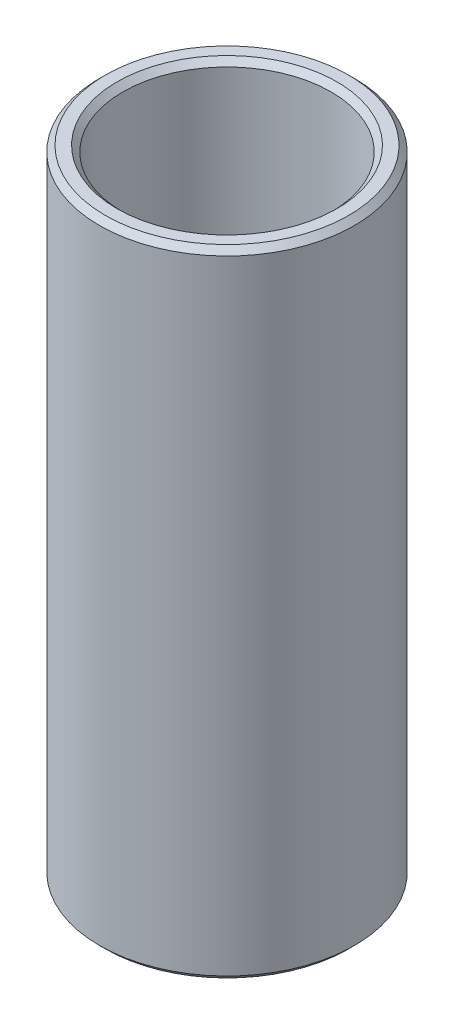
ISO-10303-21;
HEADER;
FILE_DESCRIPTION(('STEP AP214'),'2;1');
FILE_NAME('part.step','',(''),(''),'','','');
FILE_SCHEMA(('AUTOMOTIVE_DESIGN { 1 0 10303 214 1 1 1 1 }'));
ENDSEC;
DATA;
#1=APPLICATION_CONTEXT('core data for automotive mechanical design processes');
#2=APPLICATION_PROTOCOL_DEFINITION('international standard','automotive_design',2000,#1);
#3=PRODUCT_CONTEXT('',#1,'mechanical');
#4=PRODUCT('Part','Part','',(#3));
#5=PRODUCT_RELATED_PRODUCT_CATEGORY('part','',(#4));
#6=PRODUCT_DEFINITION_FORMATION('','',#4);
#7=PRODUCT_DEFINITION_CONTEXT('part definition',#1,'design');
#8=PRODUCT_DEFINITION('design','',#6,#7);
#9=PRODUCT_DEFINITION_SHAPE('','',#8);
#10=(LENGTH_UNIT() NAMED_UNIT(*) SI_UNIT(.MILLI.,.METRE.));
#11=(NAMED_UNIT(*) PLANE_ANGLE_UNIT() SI_UNIT($,.RADIAN.));
#12=(NAMED_UNIT(*) SI_UNIT($,.STERADIAN.) SOLID_ANGLE_UNIT());
#13=UNCERTAINTY_MEASURE_WITH_UNIT(LENGTH_MEASURE(1.E-05),#10,'distance_accuracy_value','');
#14=(GEOMETRIC_REPRESENTATION_CONTEXT(3) GLOBAL_UNCERTAINTY_ASSIGNED_CONTEXT((#13)) GLOBAL_UNIT_ASSIGNED_CONTEXT((#10,
#11,#12)) REPRESENTATION_CONTEXT('',''));
#15=CARTESIAN_POINT('',(0.,0.,0.));
#16=DIRECTION('',(0.,0.,1.));
#17=DIRECTION('',(1.,0.,0.));
#18=AXIS2_PLACEMENT_3D('',#15,#16,#17);
#19=CARTESIAN_POINT('',(0.,149.494594200961,0.));
#20=DIRECTION('',(0.,-1.,0.));
#21=DIRECTION('',(0.,0.,-1.));
#22=AXIS2_PLACEMENT_3D('',#19,#20,#21);
#23=CYLINDRICAL_SURFACE('',#22,30.);
#24=CARTESIAN_POINT('',(0.,1.36887821409001,0.));
#25=DIRECTION('',(0.,1.,0.));
#26=DIRECTION('',(0.,0.,1.));
#27=AXIS2_PLACEMENT_3D('',#24,#25,#26);
#28=CIRCLE('',#27,30.);
#29=CARTESIAN_POINT('',(0.,1.36887821409001,30.));
#30=VERTEX_POINT('',#29);
#31=EDGE_CURVE('E10',#30,#30,#28,.T.);
#32=ORIENTED_EDGE('',*,*,#31,.T.);
#33=EDGE_LOOP('',(#32));
#34=FACE_BOUND('',#33,.T.);
#35=CARTESIAN_POINT('',(0.,148.125715986871,0.));
#36=DIRECTION('',(0.,1.,0.));
#37=DIRECTION('',(0.,0.,1.));
#38=AXIS2_PLACEMENT_3D('',#35,#36,#37);
#39=CIRCLE('',#38,30.);
#40=CARTESIAN_POINT('',(0.,148.125715986871,30.));
#41=VERTEX_POINT('',#40);
#42=EDGE_CURVE('E50',#41,#41,#39,.F.);
#43=ORIENTED_EDGE('',*,*,#42,.T.);
#44=EDGE_LOOP('',(#43));
#45=FACE_BOUND('',#44,.T.);
#46=ADVANCED_FACE('F39',(#34,#45),#23,.T.);
#47=CARTESIAN_POINT('',(0.,149.494594200961,0.));
#48=DIRECTION('',(0.,1.,0.));
#49=DIRECTION('',(0.,0.,1.));
#50=AXIS2_PLACEMENT_3D('',#47,#48,#49);
#51=PLANE('',#50);
#52=CARTESIAN_POINT('',(0.,149.494594200961,0.));
#53=DIRECTION('',(0.,1.,0.));
#54=DIRECTION('',(0.,0.,1.));
#55=AXIS2_PLACEMENT_3D('',#52,#53,#54);
#56=CIRCLE('',#55,25.8759322180654);
#57=CARTESIAN_POINT('',(0.,149.494594200961,25.8759322180654));
#58=VERTEX_POINT('',#57);
#59=EDGE_CURVE('E58',#58,#58,#56,.F.);
#60=ORIENTED_EDGE('',*,*,#59,.T.);
#61=EDGE_LOOP('',(#60));
#62=FACE_BOUND('',#61,.T.);
#63=CARTESIAN_POINT('',(0.,149.494594200961,0.));
#64=DIRECTION('',(0.,1.,0.));
#65=DIRECTION('',(0.,0.,1.));
#66=AXIS2_PLACEMENT_3D('',#63,#64,#65);
#67=CIRCLE('',#66,28.63112178591);
#68=CARTESIAN_POINT('',(0.,149.494594200961,28.63112178591));
#69=VERTEX_POINT('',#68);
#70=EDGE_CURVE('E61',#69,#69,#67,.T.);
#71=ORIENTED_EDGE('',*,*,#70,.T.);
#72=EDGE_LOOP('',(#71));
#73=FACE_BOUND('',#72,.T.);
#74=ADVANCED_FACE('F88',(#62,#73),#51,.T.);
#75=CARTESIAN_POINT('',(0.,0.,0.));
#76=DIRECTION('',(0.,1.,0.));
#77=DIRECTION('',(0.,0.,1.));
#78=AXIS2_PLACEMENT_3D('',#75,#76,#77);
#79=PLANE('',#78);
#80=CARTESIAN_POINT('',(0.,0.,0.));
#81=DIRECTION('',(0.,1.,0.));
#82=DIRECTION('',(0.,0.,1.));
#83=AXIS2_PLACEMENT_3D('',#80,#81,#82);
#84=CIRCLE('',#83,25.8759322180654);
#85=CARTESIAN_POINT('',(0.,0.,25.8759322180654));
#86=VERTEX_POINT('',#85);
#87=EDGE_CURVE('E51',#86,#86,#84,.T.);
#88=ORIENTED_EDGE('',*,*,#87,.T.);
#89=EDGE_LOOP('',(#88));
#90=FACE_BOUND('',#89,.T.);
#91=CARTESIAN_POINT('',(0.,0.,0.));
#92=DIRECTION('',(0.,1.,0.));
#93=DIRECTION('',(0.,0.,1.));
#94=AXIS2_PLACEMENT_3D('',#91,#92,#93);
#95=CIRCLE('',#94,28.63112178591);
#96=CARTESIAN_POINT('',(0.,0.,28.63112178591));
#97=VERTEX_POINT('',#96);
#98=EDGE_CURVE('E54',#97,#97,#95,.F.);
#99=ORIENTED_EDGE('',*,*,#98,.T.);
#100=EDGE_LOOP('',(#99));
#101=FACE_BOUND('',#100,.T.);
#102=ADVANCED_FACE('F83',(#90,#101),#79,.F.);
#103=CARTESIAN_POINT('',(0.,149.494594200961,0.));
#104=DIRECTION('',(0.,-1.,0.));
#105=DIRECTION('',(0.,0.,-1.));
#106=AXIS2_PLACEMENT_3D('',#103,#104,#105);
#107=CYLINDRICAL_SURFACE('',#106,24.5070540039754);
#108=CARTESIAN_POINT('',(0.,148.125715986871,0.));
#109=DIRECTION('',(0.,1.,0.));
#110=DIRECTION('',(0.,0.,1.));
#111=AXIS2_PLACEMENT_3D('',#108,#109,#110);
#112=CIRCLE('',#111,24.5070540039754);
#113=CARTESIAN_POINT('',(0.,148.125715986871,24.5070540039754));
#114=VERTEX_POINT('',#113);
#115=EDGE_CURVE('E67',#114,#114,#112,.T.);
#116=ORIENTED_EDGE('',*,*,#115,.T.);
#117=EDGE_LOOP('',(#116));
#118=FACE_BOUND('',#117,.T.);
#119=CARTESIAN_POINT('',(0.,1.36887821409004,0.));
#120=DIRECTION('',(0.,1.,0.));
#121=DIRECTION('',(0.,0.,1.));
#122=AXIS2_PLACEMENT_3D('',#119,#120,#121);
#123=CIRCLE('',#122,24.5070540039754);
#124=CARTESIAN_POINT('',(0.,1.36887821409004,24.5070540039754));
#125=VERTEX_POINT('',#124);
#126=EDGE_CURVE('E69',#125,#125,#123,.F.);
#127=ORIENTED_EDGE('',*,*,#126,.T.);
#128=EDGE_LOOP('',(#127));
#129=FACE_BOUND('',#128,.T.);
#130=ADVANCED_FACE('F71',(#118,#129),#107,.F.);
#131=CARTESIAN_POINT('',(0.,148.125715986871,0.));
#132=DIRECTION('',(0.,1.,0.));
#133=DIRECTION('',(0.,0.,1.));
#134=AXIS2_PLACEMENT_3D('',#131,#132,#133);
#135=CONICAL_SURFACE('',#134,24.5070540039754,0.785398163397448);
#136=CARTESIAN_POINT('',(0.,149.494594200961,25.8759322180654));
#137=CARTESIAN_POINT('',(0.,149.480335052897,25.8616730700019));
#138=CARTESIAN_POINT('',(0.,149.466075904834,25.8474139219385));
#139=CARTESIAN_POINT('',(0.,149.437557608707,25.8188956258116));
#140=CARTESIAN_POINT('',(0.,149.423298460644,25.8046364777482));
#141=CARTESIAN_POINT('',(0.,149.394780164517,25.7761181816213));
#142=CARTESIAN_POINT('',(0.,149.380521016453,25.7618590335579));
#143=CARTESIAN_POINT('',(0.,149.352002720326,25.733340737431));
#144=CARTESIAN_POINT('',(0.,149.337743572263,25.7190815893676));
#145=CARTESIAN_POINT('',(0.,149.309225276136,25.6905632932407));
#146=CARTESIAN_POINT('',(0.,149.294966128073,25.6763041451772));
#147=CARTESIAN_POINT('',(0.,149.266447831946,25.6477858490504));
#148=CARTESIAN_POINT('',(0.,149.252188683882,25.6335267009869));
#149=CARTESIAN_POINT('',(0.,149.223670387755,25.6050084048601));
#150=CARTESIAN_POINT('',(0.,149.209411239692,25.5907492567966));
#151=CARTESIAN_POINT('',(0.,149.180892943565,25.5622309606697));
#152=CARTESIAN_POINT('',(0.,149.166633795502,25.5479718126063));
#153=CARTESIAN_POINT('',(0.,149.138115499375,25.5194535164794));
#154=CARTESIAN_POINT('',(0.,149.123856351311,25.505194368416));
#155=CARTESIAN_POINT('',(0.,149.095338055185,25.4766760722891));
#156=CARTESIAN_POINT('',(0.,149.081078907121,25.4624169242257));
#157=CARTESIAN_POINT('',(0.,149.052560610994,25.4338986280988));
#158=CARTESIAN_POINT('',(0.,149.038301462931,25.4196394800354));
#159=CARTESIAN_POINT('',(0.,149.009783166804,25.3911211839085));
#160=CARTESIAN_POINT('',(0.,148.99552401874,25.3768620358451));
#161=CARTESIAN_POINT('',(0.,148.967005722614,25.3483437397182));
#162=CARTESIAN_POINT('',(0.,148.95274657455,25.3340845916547));
#163=CARTESIAN_POINT('',(0.,148.924228278423,25.3055662955279));
#164=CARTESIAN_POINT('',(0.,148.90996913036,25.2913071474644));
#165=CARTESIAN_POINT('',(0.,148.881450834233,25.2627888513376));
#166=CARTESIAN_POINT('',(0.,148.86719168617,25.2485297032741));
#167=CARTESIAN_POINT('',(0.,148.838673390043,25.2200114071472));
#168=CARTESIAN_POINT('',(0.,148.824414241979,25.2057522590838));
#169=CARTESIAN_POINT('',(0.,148.795895945852,25.1772339629569));
#170=CARTESIAN_POINT('',(0.,148.781636797789,25.1629748148935));
#171=CARTESIAN_POINT('',(0.,148.753118501662,25.1344565187666));
#172=CARTESIAN_POINT('',(0.,148.738859353599,25.1201973707032));
#173=CARTESIAN_POINT('',(0.,148.710341057472,25.0916790745763));
#174=CARTESIAN_POINT('',(0.,148.696081909408,25.0774199265129));
#175=CARTESIAN_POINT('',(0.,148.667563613281,25.048901630386));
#176=CARTESIAN_POINT('',(0.,148.653304465218,25.0346424823226));
#177=CARTESIAN_POINT('',(0.,148.624786169091,25.0061241861957));
#178=CARTESIAN_POINT('',(0.,148.610527021028,24.9918650381322));
#179=CARTESIAN_POINT('',(0.,148.582008724901,24.9633467420054));
#180=CARTESIAN_POINT('',(0.,148.567749576837,24.9490875939419));
#181=CARTESIAN_POINT('',(0.,148.53923128071,24.9205692978151));
#182=CARTESIAN_POINT('',(0.,148.524972132647,24.9063101497516));
#183=CARTESIAN_POINT('',(0.,148.49645383652,24.8777918536247));
#184=CARTESIAN_POINT('',(0.,148.482194688457,24.8635327055613));
#185=CARTESIAN_POINT('',(0.,148.45367639233,24.8350144094344));
#186=CARTESIAN_POINT('',(0.,148.439417244266,24.820755261371));
#187=CARTESIAN_POINT('',(0.,148.41089894814,24.7922369652441));
#188=CARTESIAN_POINT('',(0.,148.396639800076,24.7779778171807));
#189=CARTESIAN_POINT('',(0.,148.368121503949,24.7494595210538));
#190=CARTESIAN_POINT('',(0.,148.353862355886,24.7352003729904));
#191=CARTESIAN_POINT('',(0.,148.325344059759,24.7066820768635));
#192=CARTESIAN_POINT('',(0.,148.311084911695,24.6924229288001));
#193=CARTESIAN_POINT('',(0.,148.282566615569,24.6639046326732));
#194=CARTESIAN_POINT('',(0.,148.268307467505,24.6496454846097));
#195=CARTESIAN_POINT('',(0.,148.239789171378,24.6211271884829));
#196=CARTESIAN_POINT('',(0.,148.225530023315,24.6068680404194));
#197=CARTESIAN_POINT('',(0.,148.197011727188,24.5783497442926));
#198=CARTESIAN_POINT('',(0.,148.182752579124,24.5640905962291));
#199=CARTESIAN_POINT('',(0.,148.154234282998,24.5355723001022));
#200=CARTESIAN_POINT('',(0.,148.139975134934,24.5213131520388));
#201=CARTESIAN_POINT('',(0.,148.125715986871,24.5070540039754));
#202=B_SPLINE_CURVE_WITH_KNOTS('',3,(#136,#137,#138,#139,#140,#141,#142,#143,#144,#145,#146,
#147,#148,#149,#150,#151,#152,#153,#154,#155,#156,#157,#158,#159,#160,#161,#162,#163,#164,#165,
#166,#167,#168,#169,#170,#171,#172,#173,#174,#175,#176,#177,#178,#179,#180,#181,#182,#183,#184,
#185,#186,#187,#188,#189,#190,#191,#192,#193,#194,#195,#196,#197,#198,#199,#200,#201),
.UNSPECIFIED.,.F.,.F.,(4,2,2,2,2,2,2,2,2,2,2,2,2,2,2,2,2,2,2,2,2,2,2,2,2,2,2,2,2,2,2,2,4),(0.,
0.0604964417375827,0.120992883475185,0.181489325212785,0.241985766950387,0.30248220868799,
0.36297865042559,0.423475092163172,0.483971533900775,0.544467975638377,0.60496441737598,
0.66546085911358,0.725957300851182,0.786453742588765,0.846950184326365,0.907446626063967,
0.967943067801569,1.02843950953917,1.08893595127677,1.14943239301437,1.20992883475196,
1.27042527648956,1.33092171822716,1.39141815996476,1.45191460170236,1.51241104343997,
1.57290748517755,1.63340392691515,1.69390036865275,1.75439681039035,1.81489325212795,
1.87538969386556,1.93588613560314),.UNSPECIFIED.);
#203=EDGE_CURVE('BSEAM77',#58,#114,#202,.T.);
#204=ORIENTED_EDGE('',*,*,#59,.F.);
#205=ORIENTED_EDGE('',*,*,#115,.F.);
#206=ORIENTED_EDGE('',*,*,#203,.T.);
#207=ORIENTED_EDGE('',*,*,#203,.F.);
#208=EDGE_LOOP('',(#204,#206,#205,#207));
#209=FACE_BOUND('',#208,.T.);
#210=ADVANCED_FACE('F77',(#209),#135,.F.);
#211=CARTESIAN_POINT('',(0.,0.,0.));
#212=DIRECTION('',(0.,-1.,0.));
#213=DIRECTION('',(0.,0.,-1.));
#214=AXIS2_PLACEMENT_3D('',#211,#212,#213);
#215=CONICAL_SURFACE('',#214,25.8759322180654,0.785398163397443);
#216=ORIENTED_EDGE('',*,*,#126,.F.);
#217=EDGE_LOOP('',(#216));
#218=FACE_BOUND('',#217,.T.);
#219=ORIENTED_EDGE('',*,*,#87,.F.);
#220=EDGE_LOOP('',(#219));
#221=FACE_BOUND('',#220,.T.);
#222=ADVANCED_FACE('F73',(#218,#221),#215,.F.);
#223=CARTESIAN_POINT('',(0.,1.36887821409001,0.));
#224=DIRECTION('',(0.,1.,0.));
#225=DIRECTION('',(0.,0.,1.));
#226=AXIS2_PLACEMENT_3D('',#223,#224,#225);
#227=CONICAL_SURFACE('',#226,30.,0.785398163397448);
#228=CARTESIAN_POINT('',(0.,0.,28.63112178591));
#229=CARTESIAN_POINT('',(0.,0.0142591480634366,28.6453809339734));
#230=CARTESIAN_POINT('',(0.,0.0285182961268745,28.6596400820369));
#231=CARTESIAN_POINT('',(0.,0.0570365922537503,28.6881583781637));
#232=CARTESIAN_POINT('',(0.,0.0712957403171883,28.7024175262272));
#233=CARTESIAN_POINT('',(0.,0.0998140364440636,28.730935822354));
#234=CARTESIAN_POINT('',(0.,0.114073184507501,28.7451949704175));
#235=CARTESIAN_POINT('',(0.,0.142591480634376,28.7737132665444));
#236=CARTESIAN_POINT('',(0.,0.156850628697814,28.7879724146078));
#237=CARTESIAN_POINT('',(0.,0.185368924824689,28.8164907107347));
#238=CARTESIAN_POINT('',(0.,0.199628072888126,28.8307498587981));
#239=CARTESIAN_POINT('',(0.,0.228146369015002,28.859268154925));
#240=CARTESIAN_POINT('',(0.,0.24240551707844,28.8735273029884));
#241=CARTESIAN_POINT('',(0.,0.270923813205315,28.9020455991153));
#242=CARTESIAN_POINT('',(0.,0.285182961268753,28.9163047471787));
#243=CARTESIAN_POINT('',(0.,0.313701257395628,28.9448230433056));
#244=CARTESIAN_POINT('',(0.,0.327960405459066,28.959082191369));
#245=CARTESIAN_POINT('',(0.,0.356478701585941,28.9876004874959));
#246=CARTESIAN_POINT('',(0.,0.370737849649378,29.0018596355594));
#247=CARTESIAN_POINT('',(0.,0.399256145776254,29.0303779316862));
#248=CARTESIAN_POINT('',(0.,0.413515293839692,29.0446370797497));
#249=CARTESIAN_POINT('',(0.,0.442033589966567,29.0731553758766));
#250=CARTESIAN_POINT('',(0.,0.456292738030004,29.08741452394));
#251=CARTESIAN_POINT('',(0.,0.48481103415688,29.1159328200669));
#252=CARTESIAN_POINT('',(0.,0.499070182220317,29.1301919681303));
#253=CARTESIAN_POINT('',(0.,0.527588478347193,29.1587102642572));
#254=CARTESIAN_POINT('',(0.,0.54184762641063,29.1729694123206));
#255=CARTESIAN_POINT('',(0.,0.570365922537505,29.2014877084475));
#256=CARTESIAN_POINT('',(0.,0.584625070600943,29.2157468565109));
#257=CARTESIAN_POINT('',(0.,0.613143366727819,29.2442651526378));
#258=CARTESIAN_POINT('',(0.,0.627402514791256,29.2585243007012));
#259=CARTESIAN_POINT('',(0.,0.655920810918131,29.2870425968281));
#260=CARTESIAN_POINT('',(0.,0.670179958981569,29.3013017448916));
#261=CARTESIAN_POINT('',(0.,0.698698255108444,29.3298200410184));
#262=CARTESIAN_POINT('',(0.,0.712957403171882,29.3440791890819));
#263=CARTESIAN_POINT('',(0.,0.741475699298757,29.3725974852087));
#264=CARTESIAN_POINT('',(0.,0.755734847362195,29.3868566332722));
#265=CARTESIAN_POINT('',(0.,0.78425314348907,29.4153749293991));
#266=CARTESIAN_POINT('',(0.,0.798512291552508,29.4296340774625));
#267=CARTESIAN_POINT('',(0.,0.827030587679383,29.4581523735894));
#268=CARTESIAN_POINT('',(0.,0.841289735742821,29.4724115216528));
#269=CARTESIAN_POINT('',(0.,0.869808031869696,29.5009298177797));
#270=CARTESIAN_POINT('',(0.,0.884067179933133,29.5151889658431));
#271=CARTESIAN_POINT('',(0.,0.912585476060009,29.54370726197));
#272=CARTESIAN_POINT('',(0.,0.926844624123447,29.5579664100334));
#273=CARTESIAN_POINT('',(0.,0.955362920250322,29.5864847061603));
#274=CARTESIAN_POINT('',(0.,0.96962206831376,29.6007438542237));
#275=CARTESIAN_POINT('',(0.,0.998140364440635,29.6292621503506));
#276=CARTESIAN_POINT('',(0.,1.01239951250407,29.6435212984141));
#277=CARTESIAN_POINT('',(0.,1.04091780863095,29.6720395945409));
#278=CARTESIAN_POINT('',(0.,1.05517695669439,29.6862987426044));
#279=CARTESIAN_POINT('',(0.,1.08369525282126,29.7148170387312));
#280=CARTESIAN_POINT('',(0.,1.0979544008847,29.7290761867947));
#281=CARTESIAN_POINT('',(0.,1.12647269701157,29.7575944829216));
#282=CARTESIAN_POINT('',(0.,1.14073184507501,29.771853630985));
#283=CARTESIAN_POINT('',(0.,1.16925014120189,29.8003719271119));
#284=CARTESIAN_POINT('',(0.,1.18350928926532,29.8146310751753));
#285=CARTESIAN_POINT('',(0.,1.2120275853922,29.8431493713022));
#286=CARTESIAN_POINT('',(0.,1.22628673345564,29.8574085193656));
#287=CARTESIAN_POINT('',(0.,1.25480502958251,29.8859268154925));
#288=CARTESIAN_POINT('',(0.,1.26906417764595,29.9001859635559));
#289=CARTESIAN_POINT('',(0.,1.29758247377283,29.9287042596828));
#290=CARTESIAN_POINT('',(0.,1.31184162183626,29.9429634077462));
#291=CARTESIAN_POINT('',(0.,1.34035991796314,29.9714817038731));
#292=CARTESIAN_POINT('',(0.,1.35461906602658,29.9857408519366));
#293=CARTESIAN_POINT('',(0.,1.36887821409001,30.));
#294=B_SPLINE_CURVE_WITH_KNOTS('',3,(#228,#229,#230,#231,#232,#233,#234,#235,#236,#237,#238,
#239,#240,#241,#242,#243,#244,#245,#246,#247,#248,#249,#250,#251,#252,#253,#254,#255,#256,#257,
#258,#259,#260,#261,#262,#263,#264,#265,#266,#267,#268,#269,#270,#271,#272,#273,#274,#275,#276,
#277,#278,#279,#280,#281,#282,#283,#284,#285,#286,#287,#288,#289,#290,#291,#292,#293),
.UNSPECIFIED.,.F.,.F.,(4,2,2,2,2,2,2,2,2,2,2,2,2,2,2,2,2,2,2,2,2,2,2,2,2,2,2,2,2,2,2,2,4),(0.,
0.0604964417375993,0.120992883475196,0.181489325212795,0.241985766950395,0.302482208687994,
0.362978650425591,0.42347509216319,0.48397153390079,0.544467975638389,0.604964417375986,
0.665460859113585,0.725957300851184,0.786453742588784,0.846950184326381,0.90744662606398,
0.967943067801579,1.02843950953918,1.08893595127678,1.14943239301437,1.20992883475197,
1.27042527648957,1.33092171822717,1.39141815996477,1.45191460170237,1.51241104343997,
1.57290748517757,1.63340392691516,1.69390036865276,1.75439681039036,1.81489325212796,
1.87538969386556,1.93588613560316),.UNSPECIFIED.);
#295=EDGE_CURVE('BSEAM76',#97,#30,#294,.T.);
#296=ORIENTED_EDGE('',*,*,#98,.F.);
#297=ORIENTED_EDGE('',*,*,#31,.F.);
#298=ORIENTED_EDGE('',*,*,#295,.T.);
#299=ORIENTED_EDGE('',*,*,#295,.F.);
#300=EDGE_LOOP('',(#296,#298,#297,#299));
#301=FACE_BOUND('',#300,.T.);
#302=ADVANCED_FACE('F76',(#301),#227,.T.);
#303=CARTESIAN_POINT('',(0.,149.494594200961,0.));
#304=DIRECTION('',(0.,-1.,0.));
#305=DIRECTION('',(0.,0.,-1.));
#306=AXIS2_PLACEMENT_3D('',#303,#304,#305);
#307=CONICAL_SURFACE('',#306,28.63112178591,0.785398163397452);
#308=ORIENTED_EDGE('',*,*,#42,.F.);
#309=EDGE_LOOP('',(#308));
#310=FACE_BOUND('',#309,.T.);
#311=ORIENTED_EDGE('',*,*,#70,.F.);
#312=EDGE_LOOP('',(#311));
#313=FACE_BOUND('',#312,.T.);
#314=ADVANCED_FACE('F45',(#310,#313),#307,.T.);
#315=CLOSED_SHELL('',(#46,#74,#102,#130,#210,#222,#302,#314));
#316=MANIFOLD_SOLID_BREP('B2',#315);
#317=ADVANCED_BREP_SHAPE_REPRESENTATION('',(#18,#316),#14);
#318=SHAPE_DEFINITION_REPRESENTATION(#9,#317);
ENDSEC;
END-ISO-10303-21;
